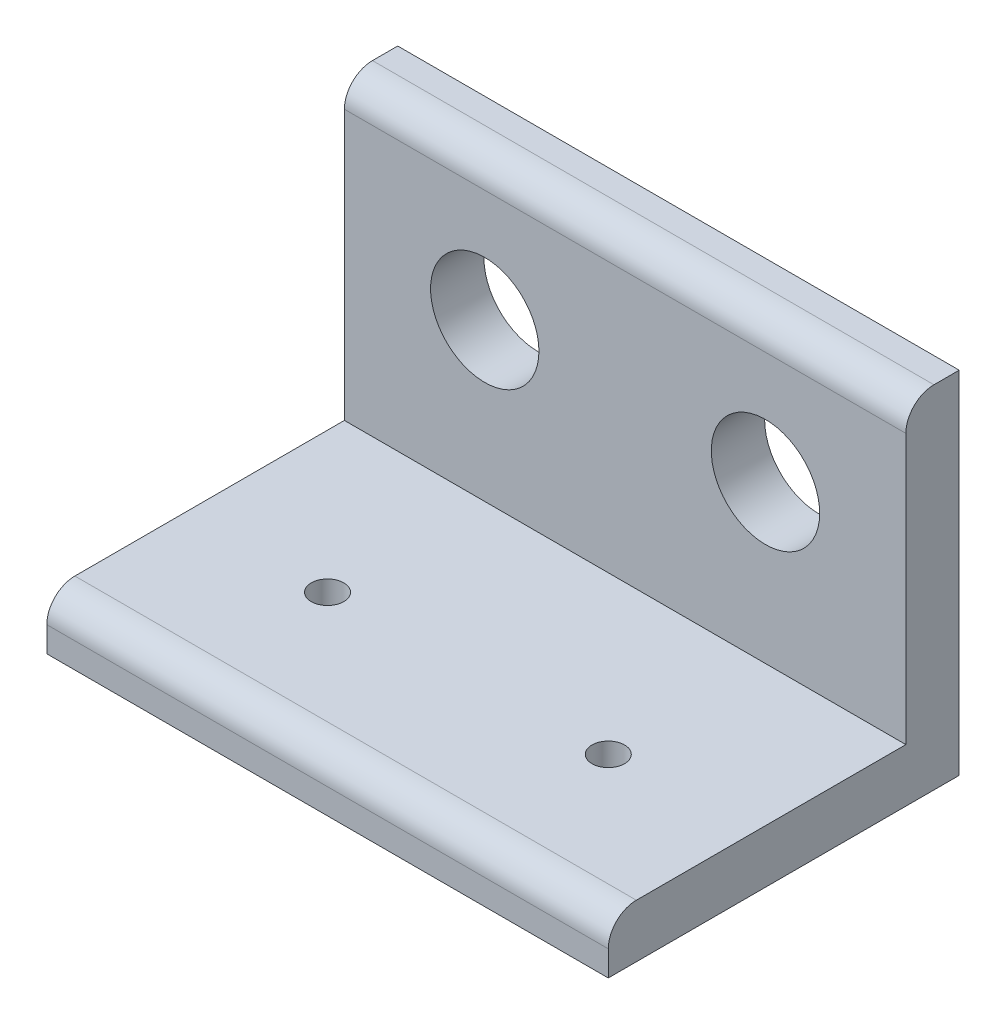
ISO-10303-21;
HEADER;
FILE_DESCRIPTION(('STEP AP214'),'2;1');
FILE_NAME('part.step','',(''),(''),'','','');
FILE_SCHEMA(('AUTOMOTIVE_DESIGN { 1 0 10303 214 1 1 1 1 }'));
ENDSEC;
DATA;
#1=APPLICATION_CONTEXT('core data for automotive mechanical design processes');
#2=APPLICATION_PROTOCOL_DEFINITION('international standard','automotive_design',2000,#1);
#3=PRODUCT_CONTEXT('',#1,'mechanical');
#4=PRODUCT('Part','Part','',(#3));
#5=PRODUCT_RELATED_PRODUCT_CATEGORY('part','',(#4));
#6=PRODUCT_DEFINITION_FORMATION('','',#4);
#7=PRODUCT_DEFINITION_CONTEXT('part definition',#1,'design');
#8=PRODUCT_DEFINITION('design','',#6,#7);
#9=PRODUCT_DEFINITION_SHAPE('','',#8);
#10=(LENGTH_UNIT() NAMED_UNIT(*) SI_UNIT(.MILLI.,.METRE.));
#11=(NAMED_UNIT(*) PLANE_ANGLE_UNIT() SI_UNIT($,.RADIAN.));
#12=(NAMED_UNIT(*) SI_UNIT($,.STERADIAN.) SOLID_ANGLE_UNIT());
#13=UNCERTAINTY_MEASURE_WITH_UNIT(LENGTH_MEASURE(1.E-05),#10,'distance_accuracy_value','');
#14=(GEOMETRIC_REPRESENTATION_CONTEXT(3) GLOBAL_UNCERTAINTY_ASSIGNED_CONTEXT((#13)) GLOBAL_UNIT_ASSIGNED_CONTEXT((#10,
#11,#12)) REPRESENTATION_CONTEXT('',''));
#15=CARTESIAN_POINT('',(0.,0.,0.));
#16=DIRECTION('',(0.,0.,1.));
#17=DIRECTION('',(1.,0.,0.));
#18=AXIS2_PLACEMENT_3D('',#15,#16,#17);
#19=CARTESIAN_POINT('',(-50.8,4.826,0.));
#20=DIRECTION('',(0.,0.,1.));
#21=DIRECTION('',(0.,-1.,0.));
#22=AXIS2_PLACEMENT_3D('',#19,#20,#21);
#23=PLANE('',#22);
#24=DIRECTION('',(0.,-1.,0.));
#25=VECTOR('',#24,1.);
#26=CARTESIAN_POINT('',(0.,4.826,0.));
#27=LINE('',#26,#25);
#28=CARTESIAN_POINT('',(0.,2.286,0.));
#29=VERTEX_POINT('',#28);
#30=CARTESIAN_POINT('',(0.,0.,0.));
#31=VERTEX_POINT('',#30);
#32=EDGE_CURVE('E131',#29,#31,#27,.T.);
#33=ORIENTED_EDGE('',*,*,#32,.F.);
#34=DIRECTION('',(1.,0.,0.));
#35=VECTOR('',#34,1.);
#36=CARTESIAN_POINT('',(-50.8,2.286,0.));
#37=LINE('',#36,#35);
#38=CARTESIAN_POINT('',(-50.8,2.286,0.));
#39=VERTEX_POINT('',#38);
#40=EDGE_CURVE('E103',#29,#39,#37,.F.);
#41=ORIENTED_EDGE('',*,*,#40,.T.);
#42=DIRECTION('',(0.,-1.,0.));
#43=VECTOR('',#42,1.);
#44=CARTESIAN_POINT('',(-50.8,4.826,0.));
#45=LINE('',#44,#43);
#46=CARTESIAN_POINT('',(-50.8,0.,0.));
#47=VERTEX_POINT('',#46);
#48=EDGE_CURVE('E97',#39,#47,#45,.T.);
#49=ORIENTED_EDGE('',*,*,#48,.T.);
#50=DIRECTION('',(1.,0.,0.));
#51=VECTOR('',#50,1.);
#52=CARTESIAN_POINT('',(-50.8,0.,0.));
#53=LINE('',#52,#51);
#54=EDGE_CURVE('E100',#47,#31,#53,.T.);
#55=ORIENTED_EDGE('',*,*,#54,.T.);
#56=EDGE_LOOP('',(#33,#41,#49,#55));
#57=FACE_BOUND('',#56,.T.);
#58=ADVANCED_FACE('F32',(#57),#23,.T.);
#59=CARTESIAN_POINT('',(-50.8,4.826,-26.924));
#60=DIRECTION('',(0.,1.,0.));
#61=DIRECTION('',(0.,0.,1.));
#62=AXIS2_PLACEMENT_3D('',#59,#60,#61);
#63=PLANE('',#62);
#64=CARTESIAN_POINT('',(-38.1,4.826,-12.7));
#65=DIRECTION('',(0.,1.,0.));
#66=DIRECTION('',(0.,0.,1.));
#67=AXIS2_PLACEMENT_3D('',#64,#65,#66);
#68=CIRCLE('',#67,1.4732);
#69=CARTESIAN_POINT('',(-38.1,4.826,-11.2268));
#70=VERTEX_POINT('',#69);
#71=EDGE_CURVE('E162',#70,#70,#68,.T.);
#72=ORIENTED_EDGE('',*,*,#71,.F.);
#73=EDGE_LOOP('',(#72));
#74=FACE_BOUND('',#73,.T.);
#75=CARTESIAN_POINT('',(-12.7,4.826,-12.7));
#76=DIRECTION('',(0.,1.,0.));
#77=DIRECTION('',(0.,0.,1.));
#78=AXIS2_PLACEMENT_3D('',#75,#76,#77);
#79=CIRCLE('',#78,1.4732);
#80=CARTESIAN_POINT('',(-12.7,4.826,-11.2268));
#81=VERTEX_POINT('',#80);
#82=EDGE_CURVE('E251',#81,#81,#79,.T.);
#83=ORIENTED_EDGE('',*,*,#82,.F.);
#84=EDGE_LOOP('',(#83));
#85=FACE_BOUND('',#84,.T.);
#86=DIRECTION('',(0.,0.,1.));
#87=VECTOR('',#86,1.);
#88=CARTESIAN_POINT('',(-50.8,4.826,-26.924));
#89=LINE('',#88,#87);
#90=CARTESIAN_POINT('',(-50.8,4.826,-26.924));
#91=VERTEX_POINT('',#90);
#92=CARTESIAN_POINT('',(-50.8,4.826,-2.54000000000001));
#93=VERTEX_POINT('',#92);
#94=EDGE_CURVE('E115',#91,#93,#89,.T.);
#95=ORIENTED_EDGE('',*,*,#94,.T.);
#96=DIRECTION('',(1.,0.,0.));
#97=VECTOR('',#96,1.);
#98=CARTESIAN_POINT('',(-50.8,4.826,-2.54));
#99=LINE('',#98,#97);
#100=CARTESIAN_POINT('',(0.,4.826,-2.54000000000001));
#101=VERTEX_POINT('',#100);
#102=EDGE_CURVE('E148',#93,#101,#99,.T.);
#103=ORIENTED_EDGE('',*,*,#102,.T.);
#104=DIRECTION('',(0.,0.,1.));
#105=VECTOR('',#104,1.);
#106=CARTESIAN_POINT('',(0.,4.826,-26.924));
#107=LINE('',#106,#105);
#108=CARTESIAN_POINT('',(0.,4.826,-26.924));
#109=VERTEX_POINT('',#108);
#110=EDGE_CURVE('E107',#109,#101,#107,.T.);
#111=ORIENTED_EDGE('',*,*,#110,.F.);
#112=DIRECTION('',(1.,0.,0.));
#113=VECTOR('',#112,1.);
#114=CARTESIAN_POINT('',(-50.8,4.826,-26.924));
#115=LINE('',#114,#113);
#116=EDGE_CURVE('E145',#91,#109,#115,.T.);
#117=ORIENTED_EDGE('',*,*,#116,.F.);
#118=EDGE_LOOP('',(#95,#103,#111,#117));
#119=FACE_BOUND('',#118,.T.);
#120=ADVANCED_FACE('F200',(#74,#85,#119),#63,.T.);
#121=CARTESIAN_POINT('',(-50.8,31.75,-26.924));
#122=DIRECTION('',(0.,0.,1.));
#123=DIRECTION('',(0.,-1.,0.));
#124=AXIS2_PLACEMENT_3D('',#121,#122,#123);
#125=PLANE('',#124);
#126=CARTESIAN_POINT('',(-38.1,19.05,-26.924));
#127=DIRECTION('',(0.,0.,1.));
#128=DIRECTION('',(1.,0.,0.));
#129=AXIS2_PLACEMENT_3D('',#126,#127,#128);
#130=CIRCLE('',#129,4.90220000000001);
#131=CARTESIAN_POINT('',(-33.1978,19.05,-26.924));
#132=VERTEX_POINT('',#131);
#133=EDGE_CURVE('E155',#132,#132,#130,.T.);
#134=ORIENTED_EDGE('',*,*,#133,.F.);
#135=EDGE_LOOP('',(#134));
#136=FACE_BOUND('',#135,.T.);
#137=CARTESIAN_POINT('',(-12.7,19.05,-26.924));
#138=DIRECTION('',(0.,0.,1.));
#139=DIRECTION('',(1.,0.,0.));
#140=AXIS2_PLACEMENT_3D('',#137,#138,#139);
#141=CIRCLE('',#140,4.9022);
#142=CARTESIAN_POINT('',(-7.7978,19.05,-26.924));
#143=VERTEX_POINT('',#142);
#144=EDGE_CURVE('E165',#143,#143,#141,.T.);
#145=ORIENTED_EDGE('',*,*,#144,.F.);
#146=EDGE_LOOP('',(#145));
#147=FACE_BOUND('',#146,.T.);
#148=DIRECTION('',(0.,-1.,0.));
#149=VECTOR('',#148,1.);
#150=CARTESIAN_POINT('',(0.,31.75,-26.924));
#151=LINE('',#150,#149);
#152=CARTESIAN_POINT('',(0.,29.21,-26.924));
#153=VERTEX_POINT('',#152);
#154=EDGE_CURVE('E141',#153,#109,#151,.T.);
#155=ORIENTED_EDGE('',*,*,#154,.F.);
#156=DIRECTION('',(1.,0.,0.));
#157=VECTOR('',#156,1.);
#158=CARTESIAN_POINT('',(-50.8,29.21,-26.924));
#159=LINE('',#158,#157);
#160=CARTESIAN_POINT('',(-50.8,29.21,-26.924));
#161=VERTEX_POINT('',#160);
#162=EDGE_CURVE('E11',#153,#161,#159,.F.);
#163=ORIENTED_EDGE('',*,*,#162,.T.);
#164=DIRECTION('',(0.,-1.,0.));
#165=VECTOR('',#164,1.);
#166=CARTESIAN_POINT('',(-50.8,31.75,-26.924));
#167=LINE('',#166,#165);
#168=EDGE_CURVE('E127',#161,#91,#167,.T.);
#169=ORIENTED_EDGE('',*,*,#168,.T.);
#170=ORIENTED_EDGE('',*,*,#116,.T.);
#171=EDGE_LOOP('',(#155,#163,#169,#170));
#172=FACE_BOUND('',#171,.T.);
#173=ADVANCED_FACE('F195',(#136,#147,#172),#125,.T.);
#174=CARTESIAN_POINT('',(-50.8,31.75,-31.75));
#175=DIRECTION('',(0.,1.,0.));
#176=DIRECTION('',(0.,0.,1.));
#177=AXIS2_PLACEMENT_3D('',#174,#175,#176);
#178=PLANE('',#177);
#179=DIRECTION('',(0.,0.,1.));
#180=VECTOR('',#179,1.);
#181=CARTESIAN_POINT('',(-50.8,31.75,-31.75));
#182=LINE('',#181,#180);
#183=CARTESIAN_POINT('',(-50.8,31.75,-31.75));
#184=VERTEX_POINT('',#183);
#185=CARTESIAN_POINT('',(-50.8,31.75,-29.464));
#186=VERTEX_POINT('',#185);
#187=EDGE_CURVE('E122',#184,#186,#182,.T.);
#188=ORIENTED_EDGE('',*,*,#187,.T.);
#189=DIRECTION('',(1.,0.,0.));
#190=VECTOR('',#189,1.);
#191=CARTESIAN_POINT('',(-50.8,31.75,-29.464));
#192=LINE('',#191,#190);
#193=CARTESIAN_POINT('',(0.,31.75,-29.464));
#194=VERTEX_POINT('',#193);
#195=EDGE_CURVE('E40',#186,#194,#192,.T.);
#196=ORIENTED_EDGE('',*,*,#195,.T.);
#197=DIRECTION('',(0.,0.,1.));
#198=VECTOR('',#197,1.);
#199=CARTESIAN_POINT('',(0.,31.75,-31.75));
#200=LINE('',#199,#198);
#201=CARTESIAN_POINT('',(0.,31.75,-31.75));
#202=VERTEX_POINT('',#201);
#203=EDGE_CURVE('E138',#202,#194,#200,.T.);
#204=ORIENTED_EDGE('',*,*,#203,.F.);
#205=DIRECTION('',(1.,0.,0.));
#206=VECTOR('',#205,1.);
#207=CARTESIAN_POINT('',(-50.8,31.75,-31.75));
#208=LINE('',#207,#206);
#209=EDGE_CURVE('E149',#184,#202,#208,.T.);
#210=ORIENTED_EDGE('',*,*,#209,.F.);
#211=EDGE_LOOP('',(#188,#196,#204,#210));
#212=FACE_BOUND('',#211,.T.);
#213=ADVANCED_FACE('F179',(#212),#178,.T.);
#214=CARTESIAN_POINT('',(-50.8,0.,-31.75));
#215=DIRECTION('',(0.,0.,-1.));
#216=DIRECTION('',(-1.,0.,0.));
#217=AXIS2_PLACEMENT_3D('',#214,#215,#216);
#218=PLANE('',#217);
#219=CARTESIAN_POINT('',(-38.1,19.05,-31.75));
#220=DIRECTION('',(0.,0.,-1.));
#221=DIRECTION('',(-1.,0.,0.));
#222=AXIS2_PLACEMENT_3D('',#219,#220,#221);
#223=CIRCLE('',#222,4.90220000000001);
#224=CARTESIAN_POINT('',(-43.0022,19.05,-31.75));
#225=VERTEX_POINT('',#224);
#226=EDGE_CURVE('E133',#225,#225,#223,.T.);
#227=ORIENTED_EDGE('',*,*,#226,.F.);
#228=EDGE_LOOP('',(#227));
#229=FACE_BOUND('',#228,.T.);
#230=CARTESIAN_POINT('',(-12.7,19.05,-31.75));
#231=DIRECTION('',(0.,0.,-1.));
#232=DIRECTION('',(-1.,0.,0.));
#233=AXIS2_PLACEMENT_3D('',#230,#231,#232);
#234=CIRCLE('',#233,4.9022);
#235=CARTESIAN_POINT('',(-17.6022,19.05,-31.75));
#236=VERTEX_POINT('',#235);
#237=EDGE_CURVE('E152',#236,#236,#234,.T.);
#238=ORIENTED_EDGE('',*,*,#237,.F.);
#239=EDGE_LOOP('',(#238));
#240=FACE_BOUND('',#239,.T.);
#241=DIRECTION('',(0.,1.,0.));
#242=VECTOR('',#241,1.);
#243=CARTESIAN_POINT('',(0.,0.,-31.75));
#244=LINE('',#243,#242);
#245=CARTESIAN_POINT('',(0.,0.,-31.75));
#246=VERTEX_POINT('',#245);
#247=EDGE_CURVE('E135',#246,#202,#244,.T.);
#248=ORIENTED_EDGE('',*,*,#247,.F.);
#249=DIRECTION('',(1.,0.,0.));
#250=VECTOR('',#249,1.);
#251=CARTESIAN_POINT('',(-50.8,0.,-31.75));
#252=LINE('',#251,#250);
#253=CARTESIAN_POINT('',(-50.8,0.,-31.75));
#254=VERTEX_POINT('',#253);
#255=EDGE_CURVE('E114',#254,#246,#252,.T.);
#256=ORIENTED_EDGE('',*,*,#255,.F.);
#257=DIRECTION('',(0.,1.,0.));
#258=VECTOR('',#257,1.);
#259=CARTESIAN_POINT('',(-50.8,0.,-31.75));
#260=LINE('',#259,#258);
#261=EDGE_CURVE('E120',#254,#184,#260,.T.);
#262=ORIENTED_EDGE('',*,*,#261,.T.);
#263=ORIENTED_EDGE('',*,*,#209,.T.);
#264=EDGE_LOOP('',(#248,#256,#262,#263));
#265=FACE_BOUND('',#264,.T.);
#266=ADVANCED_FACE('F185',(#229,#240,#265),#218,.T.);
#267=CARTESIAN_POINT('',(-50.8,0.,0.));
#268=DIRECTION('',(0.,-1.,0.));
#269=DIRECTION('',(0.,0.,-1.));
#270=AXIS2_PLACEMENT_3D('',#267,#268,#269);
#271=PLANE('',#270);
#272=CARTESIAN_POINT('',(-38.1,0.,-12.7));
#273=DIRECTION('',(0.,-1.,0.));
#274=DIRECTION('',(0.,0.,-1.));
#275=AXIS2_PLACEMENT_3D('',#272,#273,#274);
#276=CIRCLE('',#275,1.4732);
#277=CARTESIAN_POINT('',(-38.1,0.,-14.1732));
#278=VERTEX_POINT('',#277);
#279=EDGE_CURVE('E161',#278,#278,#276,.T.);
#280=ORIENTED_EDGE('',*,*,#279,.F.);
#281=EDGE_LOOP('',(#280));
#282=FACE_BOUND('',#281,.T.);
#283=CARTESIAN_POINT('',(-12.7,0.,-12.7));
#284=DIRECTION('',(0.,-1.,0.));
#285=DIRECTION('',(0.,0.,-1.));
#286=AXIS2_PLACEMENT_3D('',#283,#284,#285);
#287=CIRCLE('',#286,1.4732);
#288=CARTESIAN_POINT('',(-12.7,0.,-14.1732));
#289=VERTEX_POINT('',#288);
#290=EDGE_CURVE('E158',#289,#289,#287,.T.);
#291=ORIENTED_EDGE('',*,*,#290,.F.);
#292=EDGE_LOOP('',(#291));
#293=FACE_BOUND('',#292,.T.);
#294=DIRECTION('',(0.,0.,-1.));
#295=VECTOR('',#294,1.);
#296=CARTESIAN_POINT('',(0.,0.,0.));
#297=LINE('',#296,#295);
#298=EDGE_CURVE('E113',#31,#246,#297,.T.);
#299=ORIENTED_EDGE('',*,*,#298,.F.);
#300=ORIENTED_EDGE('',*,*,#54,.F.);
#301=DIRECTION('',(0.,0.,-1.));
#302=VECTOR('',#301,1.);
#303=CARTESIAN_POINT('',(-50.8,0.,0.));
#304=LINE('',#303,#302);
#305=EDGE_CURVE('E106',#47,#254,#304,.T.);
#306=ORIENTED_EDGE('',*,*,#305,.T.);
#307=ORIENTED_EDGE('',*,*,#255,.T.);
#308=EDGE_LOOP('',(#299,#300,#306,#307));
#309=FACE_BOUND('',#308,.T.);
#310=ADVANCED_FACE('F111',(#282,#293,#309),#271,.T.);
#311=CARTESIAN_POINT('',(-50.8,0.,0.));
#312=DIRECTION('',(1.,0.,0.));
#313=DIRECTION('',(0.,0.,-1.));
#314=AXIS2_PLACEMENT_3D('',#311,#312,#313);
#315=PLANE('',#314);
#316=ORIENTED_EDGE('',*,*,#48,.F.);
#317=CARTESIAN_POINT('',(-50.8,2.286,-2.54));
#318=DIRECTION('',(1.,0.,0.));
#319=DIRECTION('',(0.,0.,-1.));
#320=AXIS2_PLACEMENT_3D('',#317,#318,#319);
#321=CIRCLE('',#320,2.54);
#322=EDGE_CURVE('E174',#39,#93,#321,.F.);
#323=ORIENTED_EDGE('',*,*,#322,.T.);
#324=ORIENTED_EDGE('',*,*,#94,.F.);
#325=ORIENTED_EDGE('',*,*,#168,.F.);
#326=CARTESIAN_POINT('',(-50.8,29.21,-29.464));
#327=DIRECTION('',(1.,0.,0.));
#328=DIRECTION('',(0.,0.,-1.));
#329=AXIS2_PLACEMENT_3D('',#326,#327,#328);
#330=CIRCLE('',#329,2.54);
#331=EDGE_CURVE('E47',#161,#186,#330,.F.);
#332=ORIENTED_EDGE('',*,*,#331,.T.);
#333=ORIENTED_EDGE('',*,*,#187,.F.);
#334=ORIENTED_EDGE('',*,*,#261,.F.);
#335=ORIENTED_EDGE('',*,*,#305,.F.);
#336=EDGE_LOOP('',(#316,#323,#324,#325,#332,#333,#334,#335));
#337=FACE_BOUND('',#336,.T.);
#338=ADVANCED_FACE('F118',(#337),#315,.F.);
#339=CARTESIAN_POINT('',(0.,0.,0.));
#340=DIRECTION('',(1.,0.,0.));
#341=DIRECTION('',(0.,0.,-1.));
#342=AXIS2_PLACEMENT_3D('',#339,#340,#341);
#343=PLANE('',#342);
#344=ORIENTED_EDGE('',*,*,#110,.T.);
#345=CARTESIAN_POINT('',(0.,2.286,-2.54));
#346=DIRECTION('',(1.,0.,0.));
#347=DIRECTION('',(0.,0.,-1.));
#348=AXIS2_PLACEMENT_3D('',#345,#346,#347);
#349=CIRCLE('',#348,2.54);
#350=EDGE_CURVE('E170',#101,#29,#349,.T.);
#351=ORIENTED_EDGE('',*,*,#350,.T.);
#352=ORIENTED_EDGE('',*,*,#32,.T.);
#353=ORIENTED_EDGE('',*,*,#298,.T.);
#354=ORIENTED_EDGE('',*,*,#247,.T.);
#355=ORIENTED_EDGE('',*,*,#203,.T.);
#356=CARTESIAN_POINT('',(0.,29.21,-29.464));
#357=DIRECTION('',(1.,0.,0.));
#358=DIRECTION('',(0.,0.,-1.));
#359=AXIS2_PLACEMENT_3D('',#356,#357,#358);
#360=CIRCLE('',#359,2.54);
#361=EDGE_CURVE('E168',#194,#153,#360,.T.);
#362=ORIENTED_EDGE('',*,*,#361,.T.);
#363=ORIENTED_EDGE('',*,*,#154,.T.);
#364=EDGE_LOOP('',(#344,#351,#352,#353,#354,#355,#362,#363));
#365=FACE_BOUND('',#364,.T.);
#366=ADVANCED_FACE('F182',(#365),#343,.T.);
#367=CARTESIAN_POINT('',(-12.7,19.05,-77.724));
#368=DIRECTION('',(0.,0.,1.));
#369=DIRECTION('',(1.,0.,0.));
#370=AXIS2_PLACEMENT_3D('',#367,#368,#369);
#371=CYLINDRICAL_SURFACE('',#370,4.9022);
#372=ORIENTED_EDGE('',*,*,#237,.T.);
#373=EDGE_LOOP('',(#372));
#374=FACE_BOUND('',#373,.T.);
#375=ORIENTED_EDGE('',*,*,#144,.T.);
#376=EDGE_LOOP('',(#375));
#377=FACE_BOUND('',#376,.T.);
#378=ADVANCED_FACE('F233',(#374,#377),#371,.F.);
#379=CARTESIAN_POINT('',(-38.1,19.05,-77.724));
#380=DIRECTION('',(0.,0.,1.));
#381=DIRECTION('',(1.,0.,0.));
#382=AXIS2_PLACEMENT_3D('',#379,#380,#381);
#383=CYLINDRICAL_SURFACE('',#382,4.90220000000001);
#384=ORIENTED_EDGE('',*,*,#226,.T.);
#385=EDGE_LOOP('',(#384));
#386=FACE_BOUND('',#385,.T.);
#387=ORIENTED_EDGE('',*,*,#133,.T.);
#388=EDGE_LOOP('',(#387));
#389=FACE_BOUND('',#388,.T.);
#390=ADVANCED_FACE('F238',(#386,#389),#383,.F.);
#391=CARTESIAN_POINT('',(-12.7,-45.974,-12.7));
#392=DIRECTION('',(0.,1.,0.));
#393=DIRECTION('',(0.,0.,1.));
#394=AXIS2_PLACEMENT_3D('',#391,#392,#393);
#395=CYLINDRICAL_SURFACE('',#394,1.4732);
#396=ORIENTED_EDGE('',*,*,#290,.T.);
#397=EDGE_LOOP('',(#396));
#398=FACE_BOUND('',#397,.T.);
#399=ORIENTED_EDGE('',*,*,#82,.T.);
#400=EDGE_LOOP('',(#399));
#401=FACE_BOUND('',#400,.T.);
#402=ADVANCED_FACE('F215',(#398,#401),#395,.F.);
#403=CARTESIAN_POINT('',(-38.1,-45.974,-12.7));
#404=DIRECTION('',(0.,1.,0.));
#405=DIRECTION('',(0.,0.,1.));
#406=AXIS2_PLACEMENT_3D('',#403,#404,#405);
#407=CYLINDRICAL_SURFACE('',#406,1.4732);
#408=ORIENTED_EDGE('',*,*,#279,.T.);
#409=EDGE_LOOP('',(#408));
#410=FACE_BOUND('',#409,.T.);
#411=ORIENTED_EDGE('',*,*,#71,.T.);
#412=EDGE_LOOP('',(#411));
#413=FACE_BOUND('',#412,.T.);
#414=ADVANCED_FACE('F209',(#410,#413),#407,.F.);
#415=CARTESIAN_POINT('',(-50.8,2.286,-2.54));
#416=DIRECTION('',(1.,0.,0.));
#417=DIRECTION('',(0.,0.,-1.));
#418=AXIS2_PLACEMENT_3D('',#415,#416,#417);
#419=CYLINDRICAL_SURFACE('',#418,2.54);
#420=ORIENTED_EDGE('',*,*,#322,.F.);
#421=ORIENTED_EDGE('',*,*,#40,.F.);
#422=ORIENTED_EDGE('',*,*,#350,.F.);
#423=ORIENTED_EDGE('',*,*,#102,.F.);
#424=EDGE_LOOP('',(#420,#421,#422,#423));
#425=FACE_BOUND('',#424,.T.);
#426=ADVANCED_FACE('F207',(#425),#419,.T.);
#427=CARTESIAN_POINT('',(-50.8,29.21,-29.464));
#428=DIRECTION('',(1.,0.,0.));
#429=DIRECTION('',(0.,0.,-1.));
#430=AXIS2_PLACEMENT_3D('',#427,#428,#429);
#431=CYLINDRICAL_SURFACE('',#430,2.54);
#432=ORIENTED_EDGE('',*,*,#331,.F.);
#433=ORIENTED_EDGE('',*,*,#162,.F.);
#434=ORIENTED_EDGE('',*,*,#361,.F.);
#435=ORIENTED_EDGE('',*,*,#195,.F.);
#436=EDGE_LOOP('',(#432,#433,#434,#435));
#437=FACE_BOUND('',#436,.T.);
#438=ADVANCED_FACE('F34',(#437),#431,.T.);
#439=CLOSED_SHELL('',(#58,#120,#173,#213,#266,#310,#338,#366,#378,#390,#402,#414,#426,#438));
#440=MANIFOLD_SOLID_BREP('B2',#439);
#441=ADVANCED_BREP_SHAPE_REPRESENTATION('',(#18,#440),#14);
#442=SHAPE_DEFINITION_REPRESENTATION(#9,#441);
ENDSEC;
END-ISO-10303-21;
